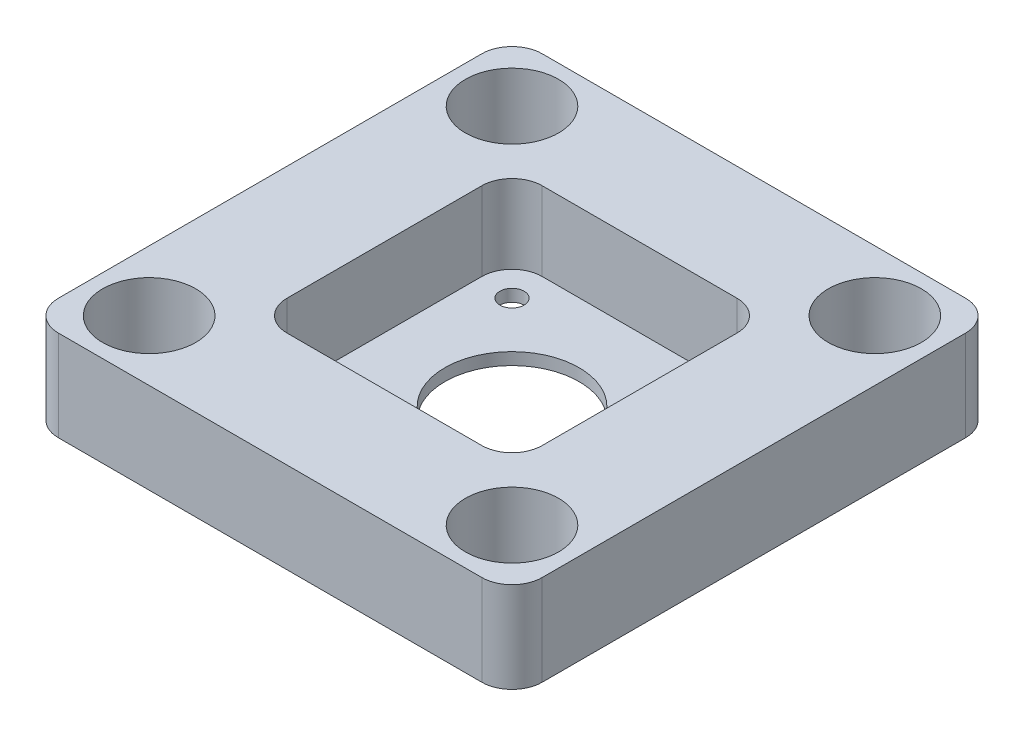
ISO-10303-21;
HEADER;
FILE_DESCRIPTION(('STEP AP214'),'2;1');
FILE_NAME('part.step','',(''),(''),'','','');
FILE_SCHEMA(('AUTOMOTIVE_DESIGN { 1 0 10303 214 1 1 1 1 }'));
ENDSEC;
DATA;
#1=APPLICATION_CONTEXT('core data for automotive mechanical design processes');
#2=APPLICATION_PROTOCOL_DEFINITION('international standard','automotive_design',2000,#1);
#3=PRODUCT_CONTEXT('',#1,'mechanical');
#4=PRODUCT('Part','Part','',(#3));
#5=PRODUCT_RELATED_PRODUCT_CATEGORY('part','',(#4));
#6=PRODUCT_DEFINITION_FORMATION('','',#4);
#7=PRODUCT_DEFINITION_CONTEXT('part definition',#1,'design');
#8=PRODUCT_DEFINITION('design','',#6,#7);
#9=PRODUCT_DEFINITION_SHAPE('','',#8);
#10=(LENGTH_UNIT() NAMED_UNIT(*) SI_UNIT(.MILLI.,.METRE.));
#11=(NAMED_UNIT(*) PLANE_ANGLE_UNIT() SI_UNIT($,.RADIAN.));
#12=(NAMED_UNIT(*) SI_UNIT($,.STERADIAN.) SOLID_ANGLE_UNIT());
#13=UNCERTAINTY_MEASURE_WITH_UNIT(LENGTH_MEASURE(1.E-05),#10,'distance_accuracy_value','');
#14=(GEOMETRIC_REPRESENTATION_CONTEXT(3) GLOBAL_UNCERTAINTY_ASSIGNED_CONTEXT((#13)) GLOBAL_UNIT_ASSIGNED_CONTEXT((#10,
#11,#12)) REPRESENTATION_CONTEXT('',''));
#15=CARTESIAN_POINT('',(0.,0.,0.));
#16=DIRECTION('',(0.,0.,1.));
#17=DIRECTION('',(1.,0.,0.));
#18=AXIS2_PLACEMENT_3D('',#15,#16,#17);
#19=CARTESIAN_POINT('',(-40.,15.,40.));
#20=DIRECTION('',(1.,0.,0.));
#21=DIRECTION('',(0.,0.,-1.));
#22=AXIS2_PLACEMENT_3D('',#19,#20,#21);
#23=PLANE('',#22);
#24=DIRECTION('',(0.,0.,1.));
#25=VECTOR('',#24,1.);
#26=CARTESIAN_POINT('',(-40.,15.,40.));
#27=LINE('',#26,#25);
#28=CARTESIAN_POINT('',(-40.,15.,-35.));
#29=VERTEX_POINT('',#28);
#30=CARTESIAN_POINT('',(-40.,15.,35.));
#31=VERTEX_POINT('',#30);
#32=EDGE_CURVE('E183',#29,#31,#27,.T.);
#33=ORIENTED_EDGE('',*,*,#32,.F.);
#34=DIRECTION('',(0.,-1.,0.));
#35=VECTOR('',#34,1.);
#36=CARTESIAN_POINT('',(-40.,15.,-35.));
#37=LINE('',#36,#35);
#38=CARTESIAN_POINT('',(-40.,0.,-35.));
#39=VERTEX_POINT('',#38);
#40=EDGE_CURVE('E233',#29,#39,#37,.T.);
#41=ORIENTED_EDGE('',*,*,#40,.T.);
#42=DIRECTION('',(0.,0.,1.));
#43=VECTOR('',#42,1.);
#44=CARTESIAN_POINT('',(-40.,0.,40.));
#45=LINE('',#44,#43);
#46=CARTESIAN_POINT('',(-40.,0.,35.));
#47=VERTEX_POINT('',#46);
#48=EDGE_CURVE('E194',#39,#47,#45,.T.);
#49=ORIENTED_EDGE('',*,*,#48,.T.);
#50=DIRECTION('',(0.,-1.,0.));
#51=VECTOR('',#50,1.);
#52=CARTESIAN_POINT('',(-40.,15.,35.));
#53=LINE('',#52,#51);
#54=EDGE_CURVE('E231',#47,#31,#53,.F.);
#55=ORIENTED_EDGE('',*,*,#54,.T.);
#56=EDGE_LOOP('',(#33,#41,#49,#55));
#57=FACE_BOUND('',#56,.T.);
#58=ADVANCED_FACE('F32',(#57),#23,.F.);
#59=CARTESIAN_POINT('',(40.,15.,40.));
#60=DIRECTION('',(0.,0.,-1.));
#61=DIRECTION('',(-1.,0.,0.));
#62=AXIS2_PLACEMENT_3D('',#59,#60,#61);
#63=PLANE('',#62);
#64=DIRECTION('',(1.,0.,0.));
#65=VECTOR('',#64,1.);
#66=CARTESIAN_POINT('',(40.,0.,40.));
#67=LINE('',#66,#65);
#68=CARTESIAN_POINT('',(-35.,0.,40.));
#69=VERTEX_POINT('',#68);
#70=CARTESIAN_POINT('',(35.,0.,40.));
#71=VERTEX_POINT('',#70);
#72=EDGE_CURVE('E197',#69,#71,#67,.T.);
#73=ORIENTED_EDGE('',*,*,#72,.T.);
#74=DIRECTION('',(0.,-1.,0.));
#75=VECTOR('',#74,1.);
#76=CARTESIAN_POINT('',(35.,15.,40.));
#77=LINE('',#76,#75);
#78=CARTESIAN_POINT('',(35.,15.,40.));
#79=VERTEX_POINT('',#78);
#80=EDGE_CURVE('E11',#71,#79,#77,.F.);
#81=ORIENTED_EDGE('',*,*,#80,.T.);
#82=DIRECTION('',(1.,0.,0.));
#83=VECTOR('',#82,1.);
#84=CARTESIAN_POINT('',(40.,15.,40.));
#85=LINE('',#84,#83);
#86=CARTESIAN_POINT('',(-35.,15.,40.));
#87=VERTEX_POINT('',#86);
#88=EDGE_CURVE('E186',#87,#79,#85,.T.);
#89=ORIENTED_EDGE('',*,*,#88,.F.);
#90=DIRECTION('',(0.,-1.,0.));
#91=VECTOR('',#90,1.);
#92=CARTESIAN_POINT('',(-35.,15.,40.));
#93=LINE('',#92,#91);
#94=EDGE_CURVE('E40',#87,#69,#93,.T.);
#95=ORIENTED_EDGE('',*,*,#94,.T.);
#96=EDGE_LOOP('',(#73,#81,#89,#95));
#97=FACE_BOUND('',#96,.T.);
#98=ADVANCED_FACE('F264',(#97),#63,.F.);
#99=CARTESIAN_POINT('',(40.,15.,40.));
#100=DIRECTION('',(-1.,0.,0.));
#101=DIRECTION('',(0.,0.,1.));
#102=AXIS2_PLACEMENT_3D('',#99,#100,#101);
#103=PLANE('',#102);
#104=DIRECTION('',(0.,0.,-1.));
#105=VECTOR('',#104,1.);
#106=CARTESIAN_POINT('',(40.,0.,40.));
#107=LINE('',#106,#105);
#108=CARTESIAN_POINT('',(40.,0.,35.));
#109=VERTEX_POINT('',#108);
#110=CARTESIAN_POINT('',(40.,0.,-35.));
#111=VERTEX_POINT('',#110);
#112=EDGE_CURVE('E201',#109,#111,#107,.T.);
#113=ORIENTED_EDGE('',*,*,#112,.T.);
#114=DIRECTION('',(0.,-1.,0.));
#115=VECTOR('',#114,1.);
#116=CARTESIAN_POINT('',(40.,15.,-35.));
#117=LINE('',#116,#115);
#118=CARTESIAN_POINT('',(40.,15.,-35.));
#119=VERTEX_POINT('',#118);
#120=EDGE_CURVE('E47',#111,#119,#117,.F.);
#121=ORIENTED_EDGE('',*,*,#120,.T.);
#122=DIRECTION('',(0.,0.,-1.));
#123=VECTOR('',#122,1.);
#124=CARTESIAN_POINT('',(40.,15.,40.));
#125=LINE('',#124,#123);
#126=CARTESIAN_POINT('',(40.,15.,35.));
#127=VERTEX_POINT('',#126);
#128=EDGE_CURVE('E189',#127,#119,#125,.T.);
#129=ORIENTED_EDGE('',*,*,#128,.F.);
#130=DIRECTION('',(0.,-1.,0.));
#131=VECTOR('',#130,1.);
#132=CARTESIAN_POINT('',(40.,15.,35.));
#133=LINE('',#132,#131);
#134=EDGE_CURVE('E256',#127,#109,#133,.T.);
#135=ORIENTED_EDGE('',*,*,#134,.T.);
#136=EDGE_LOOP('',(#113,#121,#129,#135));
#137=FACE_BOUND('',#136,.T.);
#138=ADVANCED_FACE('F275',(#137),#103,.F.);
#139=CARTESIAN_POINT('',(40.,15.,-40.));
#140=DIRECTION('',(0.,0.,1.));
#141=DIRECTION('',(1.,0.,0.));
#142=AXIS2_PLACEMENT_3D('',#139,#140,#141);
#143=PLANE('',#142);
#144=DIRECTION('',(-1.,0.,0.));
#145=VECTOR('',#144,1.);
#146=CARTESIAN_POINT('',(40.,0.,-40.));
#147=LINE('',#146,#145);
#148=CARTESIAN_POINT('',(35.,0.,-40.));
#149=VERTEX_POINT('',#148);
#150=CARTESIAN_POINT('',(-35.,0.,-40.));
#151=VERTEX_POINT('',#150);
#152=EDGE_CURVE('E187',#149,#151,#147,.T.);
#153=ORIENTED_EDGE('',*,*,#152,.T.);
#154=DIRECTION('',(0.,-1.,0.));
#155=VECTOR('',#154,1.);
#156=CARTESIAN_POINT('',(-35.,15.,-40.));
#157=LINE('',#156,#155);
#158=CARTESIAN_POINT('',(-35.,15.,-40.));
#159=VERTEX_POINT('',#158);
#160=EDGE_CURVE('E247',#151,#159,#157,.F.);
#161=ORIENTED_EDGE('',*,*,#160,.T.);
#162=DIRECTION('',(-1.,0.,0.));
#163=VECTOR('',#162,1.);
#164=CARTESIAN_POINT('',(40.,15.,-40.));
#165=LINE('',#164,#163);
#166=CARTESIAN_POINT('',(35.,15.,-40.));
#167=VERTEX_POINT('',#166);
#168=EDGE_CURVE('E191',#167,#159,#165,.T.);
#169=ORIENTED_EDGE('',*,*,#168,.F.);
#170=DIRECTION('',(0.,-1.,0.));
#171=VECTOR('',#170,1.);
#172=CARTESIAN_POINT('',(35.,15.,-40.));
#173=LINE('',#172,#171);
#174=EDGE_CURVE('E244',#167,#149,#173,.T.);
#175=ORIENTED_EDGE('',*,*,#174,.T.);
#176=EDGE_LOOP('',(#153,#161,#169,#175));
#177=FACE_BOUND('',#176,.T.);
#178=ADVANCED_FACE('F283',(#177),#143,.F.);
#179=CARTESIAN_POINT('',(0.,15.,0.));
#180=DIRECTION('',(0.,1.,0.));
#181=DIRECTION('',(0.,0.,1.));
#182=AXIS2_PLACEMENT_3D('',#179,#180,#181);
#183=PLANE('',#182);
#184=CARTESIAN_POINT('',(-30.,15.,30.));
#185=DIRECTION('',(0.,1.,0.));
#186=DIRECTION('',(0.,0.,-1.));
#187=AXIS2_PLACEMENT_3D('',#184,#185,#186);
#188=CIRCLE('',#187,7.7);
#189=CARTESIAN_POINT('',(-30.,15.,22.3));
#190=VERTEX_POINT('',#189);
#191=EDGE_CURVE('E551',#190,#190,#188,.T.);
#192=ORIENTED_EDGE('',*,*,#191,.F.);
#193=EDGE_LOOP('',(#192));
#194=FACE_BOUND('',#193,.T.);
#195=CARTESIAN_POINT('',(30.,15.,30.));
#196=DIRECTION('',(0.,1.,0.));
#197=DIRECTION('',(0.,0.,1.));
#198=AXIS2_PLACEMENT_3D('',#195,#196,#197);
#199=CIRCLE('',#198,7.7);
#200=CARTESIAN_POINT('',(30.,15.,37.7));
#201=VERTEX_POINT('',#200);
#202=EDGE_CURVE('E555',#201,#201,#199,.T.);
#203=ORIENTED_EDGE('',*,*,#202,.F.);
#204=EDGE_LOOP('',(#203));
#205=FACE_BOUND('',#204,.T.);
#206=CARTESIAN_POINT('',(30.,15.,-30.));
#207=DIRECTION('',(0.,1.,0.));
#208=DIRECTION('',(0.,0.,-1.));
#209=AXIS2_PLACEMENT_3D('',#206,#207,#208);
#210=CIRCLE('',#209,7.7);
#211=CARTESIAN_POINT('',(30.,15.,-37.7));
#212=VERTEX_POINT('',#211);
#213=EDGE_CURVE('E559',#212,#212,#210,.T.);
#214=ORIENTED_EDGE('',*,*,#213,.F.);
#215=EDGE_LOOP('',(#214));
#216=FACE_BOUND('',#215,.T.);
#217=CARTESIAN_POINT('',(-30.,15.,-30.));
#218=DIRECTION('',(0.,1.,0.));
#219=DIRECTION('',(0.,0.,1.));
#220=AXIS2_PLACEMENT_3D('',#217,#218,#219);
#221=CIRCLE('',#220,7.7);
#222=CARTESIAN_POINT('',(-30.,15.,-22.3));
#223=VERTEX_POINT('',#222);
#224=EDGE_CURVE('E562',#223,#223,#221,.T.);
#225=ORIENTED_EDGE('',*,*,#224,.F.);
#226=EDGE_LOOP('',(#225));
#227=FACE_BOUND('',#226,.T.);
#228=DIRECTION('',(0.,0.,1.));
#229=VECTOR('',#228,1.);
#230=CARTESIAN_POINT('',(-21.1,15.,21.1));
#231=LINE('',#230,#229);
#232=CARTESIAN_POINT('',(-21.1,15.,-16.1));
#233=VERTEX_POINT('',#232);
#234=CARTESIAN_POINT('',(-21.1,15.,16.1));
#235=VERTEX_POINT('',#234);
#236=EDGE_CURVE('E179',#233,#235,#231,.T.);
#237=ORIENTED_EDGE('',*,*,#236,.F.);
#238=CARTESIAN_POINT('',(-16.1,15.,-16.1));
#239=DIRECTION('',(0.,1.,0.));
#240=DIRECTION('',(0.,0.,1.));
#241=AXIS2_PLACEMENT_3D('',#238,#239,#240);
#242=CIRCLE('',#241,5.);
#243=CARTESIAN_POINT('',(-16.1,15.,-21.1));
#244=VERTEX_POINT('',#243);
#245=EDGE_CURVE('E229',#233,#244,#242,.F.);
#246=ORIENTED_EDGE('',*,*,#245,.T.);
#247=DIRECTION('',(-1.,0.,0.));
#248=VECTOR('',#247,1.);
#249=CARTESIAN_POINT('',(21.1,15.,-21.1));
#250=LINE('',#249,#248);
#251=CARTESIAN_POINT('',(16.1,15.,-21.1));
#252=VERTEX_POINT('',#251);
#253=EDGE_CURVE('E173',#252,#244,#250,.T.);
#254=ORIENTED_EDGE('',*,*,#253,.F.);
#255=CARTESIAN_POINT('',(16.1,15.,-16.1));
#256=DIRECTION('',(0.,1.,0.));
#257=DIRECTION('',(0.,0.,1.));
#258=AXIS2_PLACEMENT_3D('',#255,#256,#257);
#259=CIRCLE('',#258,5.);
#260=CARTESIAN_POINT('',(21.1,15.,-16.1));
#261=VERTEX_POINT('',#260);
#262=EDGE_CURVE('E156',#252,#261,#259,.F.);
#263=ORIENTED_EDGE('',*,*,#262,.T.);
#264=DIRECTION('',(0.,0.,-1.));
#265=VECTOR('',#264,1.);
#266=CARTESIAN_POINT('',(21.1,15.,21.1));
#267=LINE('',#266,#265);
#268=CARTESIAN_POINT('',(21.1,15.,16.1));
#269=VERTEX_POINT('',#268);
#270=EDGE_CURVE('E163',#269,#261,#267,.T.);
#271=ORIENTED_EDGE('',*,*,#270,.F.);
#272=CARTESIAN_POINT('',(16.1,15.,16.1));
#273=DIRECTION('',(0.,1.,0.));
#274=DIRECTION('',(0.,0.,1.));
#275=AXIS2_PLACEMENT_3D('',#272,#273,#274);
#276=CIRCLE('',#275,5.);
#277=CARTESIAN_POINT('',(16.1,15.,21.1));
#278=VERTEX_POINT('',#277);
#279=EDGE_CURVE('E146',#269,#278,#276,.F.);
#280=ORIENTED_EDGE('',*,*,#279,.T.);
#281=DIRECTION('',(1.,0.,0.));
#282=VECTOR('',#281,1.);
#283=CARTESIAN_POINT('',(21.1,15.,21.1));
#284=LINE('',#283,#282);
#285=CARTESIAN_POINT('',(-16.1,15.,21.1));
#286=VERTEX_POINT('',#285);
#287=EDGE_CURVE('E174',#286,#278,#284,.T.);
#288=ORIENTED_EDGE('',*,*,#287,.F.);
#289=CARTESIAN_POINT('',(-16.1,15.,16.1));
#290=DIRECTION('',(0.,1.,0.));
#291=DIRECTION('',(0.,0.,1.));
#292=AXIS2_PLACEMENT_3D('',#289,#290,#291);
#293=CIRCLE('',#292,5.);
#294=EDGE_CURVE('E227',#286,#235,#293,.F.);
#295=ORIENTED_EDGE('',*,*,#294,.T.);
#296=EDGE_LOOP('',(#237,#246,#254,#263,#271,#280,#288,#295));
#297=FACE_BOUND('',#296,.T.);
#298=ORIENTED_EDGE('',*,*,#168,.T.);
#299=CARTESIAN_POINT('',(-35.,15.,-35.));
#300=DIRECTION('',(0.,1.,0.));
#301=DIRECTION('',(0.,0.,1.));
#302=AXIS2_PLACEMENT_3D('',#299,#300,#301);
#303=CIRCLE('',#302,5.);
#304=EDGE_CURVE('E254',#159,#29,#303,.T.);
#305=ORIENTED_EDGE('',*,*,#304,.T.);
#306=ORIENTED_EDGE('',*,*,#32,.T.);
#307=CARTESIAN_POINT('',(-35.,15.,35.));
#308=DIRECTION('',(0.,1.,0.));
#309=DIRECTION('',(0.,0.,1.));
#310=AXIS2_PLACEMENT_3D('',#307,#308,#309);
#311=CIRCLE('',#310,5.);
#312=EDGE_CURVE('E249',#31,#87,#311,.T.);
#313=ORIENTED_EDGE('',*,*,#312,.T.);
#314=ORIENTED_EDGE('',*,*,#88,.T.);
#315=CARTESIAN_POINT('',(35.,15.,35.));
#316=DIRECTION('',(0.,1.,0.));
#317=DIRECTION('',(0.,0.,1.));
#318=AXIS2_PLACEMENT_3D('',#315,#316,#317);
#319=CIRCLE('',#318,5.);
#320=EDGE_CURVE('E54',#79,#127,#319,.T.);
#321=ORIENTED_EDGE('',*,*,#320,.T.);
#322=ORIENTED_EDGE('',*,*,#128,.T.);
#323=CARTESIAN_POINT('',(35.,15.,-35.));
#324=DIRECTION('',(0.,1.,0.));
#325=DIRECTION('',(0.,0.,1.));
#326=AXIS2_PLACEMENT_3D('',#323,#324,#325);
#327=CIRCLE('',#326,5.);
#328=EDGE_CURVE('E252',#119,#167,#327,.T.);
#329=ORIENTED_EDGE('',*,*,#328,.T.);
#330=EDGE_LOOP('',(#298,#305,#306,#313,#314,#321,#322,#329));
#331=FACE_BOUND('',#330,.T.);
#332=ADVANCED_FACE('F171',(#194,#205,#216,#227,#297,#331),#183,.T.);
#333=CARTESIAN_POINT('',(0.,0.,0.));
#334=DIRECTION('',(0.,1.,0.));
#335=DIRECTION('',(0.,0.,1.));
#336=AXIS2_PLACEMENT_3D('',#333,#334,#335);
#337=PLANE('',#336);
#338=CARTESIAN_POINT('',(-30.,0.,30.));
#339=DIRECTION('',(0.,1.,0.));
#340=DIRECTION('',(0.,0.,-1.));
#341=AXIS2_PLACEMENT_3D('',#338,#339,#340);
#342=CIRCLE('',#341,7.7);
#343=CARTESIAN_POINT('',(-30.,0.,22.3));
#344=VERTEX_POINT('',#343);
#345=EDGE_CURVE('E650',#344,#344,#342,.T.);
#346=ORIENTED_EDGE('',*,*,#345,.T.);
#347=EDGE_LOOP('',(#346));
#348=FACE_BOUND('',#347,.T.);
#349=CARTESIAN_POINT('',(30.,0.,30.));
#350=DIRECTION('',(0.,1.,0.));
#351=DIRECTION('',(0.,0.,1.));
#352=AXIS2_PLACEMENT_3D('',#349,#350,#351);
#353=CIRCLE('',#352,7.7);
#354=CARTESIAN_POINT('',(30.,0.,37.7));
#355=VERTEX_POINT('',#354);
#356=EDGE_CURVE('E647',#355,#355,#353,.T.);
#357=ORIENTED_EDGE('',*,*,#356,.T.);
#358=EDGE_LOOP('',(#357));
#359=FACE_BOUND('',#358,.T.);
#360=CARTESIAN_POINT('',(30.,0.,-30.));
#361=DIRECTION('',(0.,1.,0.));
#362=DIRECTION('',(0.,0.,-1.));
#363=AXIS2_PLACEMENT_3D('',#360,#361,#362);
#364=CIRCLE('',#363,7.7);
#365=CARTESIAN_POINT('',(30.,0.,-37.7));
#366=VERTEX_POINT('',#365);
#367=EDGE_CURVE('E565',#366,#366,#364,.T.);
#368=ORIENTED_EDGE('',*,*,#367,.T.);
#369=EDGE_LOOP('',(#368));
#370=FACE_BOUND('',#369,.T.);
#371=CARTESIAN_POINT('',(-30.,0.,-30.));
#372=DIRECTION('',(0.,1.,0.));
#373=DIRECTION('',(0.,0.,1.));
#374=AXIS2_PLACEMENT_3D('',#371,#372,#373);
#375=CIRCLE('',#374,7.7);
#376=CARTESIAN_POINT('',(-30.,0.,-22.3));
#377=VERTEX_POINT('',#376);
#378=EDGE_CURVE('E564',#377,#377,#375,.T.);
#379=ORIENTED_EDGE('',*,*,#378,.T.);
#380=EDGE_LOOP('',(#379));
#381=FACE_BOUND('',#380,.T.);
#382=CARTESIAN_POINT('',(-15.4999999999999,0.,15.5));
#383=DIRECTION('',(0.,1.,0.));
#384=DIRECTION('',(0.,0.,-1.));
#385=AXIS2_PLACEMENT_3D('',#382,#383,#384);
#386=CIRCLE('',#385,2.);
#387=CARTESIAN_POINT('',(-15.4999999999999,0.,13.5));
#388=VERTEX_POINT('',#387);
#389=EDGE_CURVE('E574',#388,#388,#386,.T.);
#390=ORIENTED_EDGE('',*,*,#389,.T.);
#391=EDGE_LOOP('',(#390));
#392=FACE_BOUND('',#391,.T.);
#393=CARTESIAN_POINT('',(15.5,0.,15.5));
#394=DIRECTION('',(0.,1.,0.));
#395=DIRECTION('',(0.,0.,1.));
#396=AXIS2_PLACEMENT_3D('',#393,#394,#395);
#397=CIRCLE('',#396,2.);
#398=CARTESIAN_POINT('',(15.5,0.,17.5));
#399=VERTEX_POINT('',#398);
#400=EDGE_CURVE('E580',#399,#399,#397,.T.);
#401=ORIENTED_EDGE('',*,*,#400,.T.);
#402=EDGE_LOOP('',(#401));
#403=FACE_BOUND('',#402,.T.);
#404=CARTESIAN_POINT('',(15.5,0.,-15.5));
#405=DIRECTION('',(0.,1.,0.));
#406=DIRECTION('',(0.,0.,-1.));
#407=AXIS2_PLACEMENT_3D('',#404,#405,#406);
#408=CIRCLE('',#407,2.);
#409=CARTESIAN_POINT('',(15.5,0.,-17.5));
#410=VERTEX_POINT('',#409);
#411=EDGE_CURVE('E586',#410,#410,#408,.T.);
#412=ORIENTED_EDGE('',*,*,#411,.T.);
#413=EDGE_LOOP('',(#412));
#414=FACE_BOUND('',#413,.T.);
#415=CARTESIAN_POINT('',(-15.5,0.,-15.5));
#416=DIRECTION('',(0.,1.,0.));
#417=DIRECTION('',(0.,0.,1.));
#418=AXIS2_PLACEMENT_3D('',#415,#416,#417);
#419=CIRCLE('',#418,2.);
#420=CARTESIAN_POINT('',(-15.5,0.,-13.5));
#421=VERTEX_POINT('',#420);
#422=EDGE_CURVE('E592',#421,#421,#419,.T.);
#423=ORIENTED_EDGE('',*,*,#422,.T.);
#424=EDGE_LOOP('',(#423));
#425=FACE_BOUND('',#424,.T.);
#426=CARTESIAN_POINT('',(0.,0.,0.));
#427=DIRECTION('',(0.,1.,0.));
#428=DIRECTION('',(0.,0.,1.));
#429=AXIS2_PLACEMENT_3D('',#426,#427,#428);
#430=CIRCLE('',#429,11.1);
#431=CARTESIAN_POINT('',(0.,0.,11.1));
#432=VERTEX_POINT('',#431);
#433=EDGE_CURVE('E598',#432,#432,#430,.T.);
#434=ORIENTED_EDGE('',*,*,#433,.T.);
#435=EDGE_LOOP('',(#434));
#436=FACE_BOUND('',#435,.T.);
#437=ORIENTED_EDGE('',*,*,#48,.F.);
#438=CARTESIAN_POINT('',(-35.,0.,-35.));
#439=DIRECTION('',(0.,1.,0.));
#440=DIRECTION('',(0.,0.,1.));
#441=AXIS2_PLACEMENT_3D('',#438,#439,#440);
#442=CIRCLE('',#441,5.);
#443=EDGE_CURVE('E242',#39,#151,#442,.F.);
#444=ORIENTED_EDGE('',*,*,#443,.T.);
#445=ORIENTED_EDGE('',*,*,#152,.F.);
#446=CARTESIAN_POINT('',(35.,0.,-35.));
#447=DIRECTION('',(0.,1.,0.));
#448=DIRECTION('',(0.,0.,1.));
#449=AXIS2_PLACEMENT_3D('',#446,#447,#448);
#450=CIRCLE('',#449,5.);
#451=EDGE_CURVE('E240',#149,#111,#450,.F.);
#452=ORIENTED_EDGE('',*,*,#451,.T.);
#453=ORIENTED_EDGE('',*,*,#112,.F.);
#454=CARTESIAN_POINT('',(35.,0.,35.));
#455=DIRECTION('',(0.,1.,0.));
#456=DIRECTION('',(0.,0.,1.));
#457=AXIS2_PLACEMENT_3D('',#454,#455,#456);
#458=CIRCLE('',#457,5.);
#459=EDGE_CURVE('E238',#109,#71,#458,.F.);
#460=ORIENTED_EDGE('',*,*,#459,.T.);
#461=ORIENTED_EDGE('',*,*,#72,.F.);
#462=CARTESIAN_POINT('',(-35.,0.,35.));
#463=DIRECTION('',(0.,1.,0.));
#464=DIRECTION('',(0.,0.,1.));
#465=AXIS2_PLACEMENT_3D('',#462,#463,#464);
#466=CIRCLE('',#465,5.);
#467=EDGE_CURVE('E236',#69,#47,#466,.F.);
#468=ORIENTED_EDGE('',*,*,#467,.T.);
#469=EDGE_LOOP('',(#437,#444,#445,#452,#453,#460,#461,#468));
#470=FACE_BOUND('',#469,.T.);
#471=ADVANCED_FACE('F270',(#348,#359,#370,#381,#392,#403,#414,#425,#436,#470),#337,.F.);
#472=CARTESIAN_POINT('',(-21.1,2.,21.1));
#473=DIRECTION('',(-1.,0.,0.));
#474=DIRECTION('',(0.,0.,1.));
#475=AXIS2_PLACEMENT_3D('',#472,#473,#474);
#476=PLANE('',#475);
#477=ORIENTED_EDGE('',*,*,#236,.T.);
#478=DIRECTION('',(0.,1.,0.));
#479=VECTOR('',#478,1.);
#480=CARTESIAN_POINT('',(-21.1,2.,16.1));
#481=LINE('',#480,#479);
#482=CARTESIAN_POINT('',(-21.1,2.,16.1));
#483=VERTEX_POINT('',#482);
#484=EDGE_CURVE('E157',#235,#483,#481,.F.);
#485=ORIENTED_EDGE('',*,*,#484,.T.);
#486=DIRECTION('',(0.,0.,1.));
#487=VECTOR('',#486,1.);
#488=CARTESIAN_POINT('',(-21.1,2.,21.1));
#489=LINE('',#488,#487);
#490=CARTESIAN_POINT('',(-21.1,2.,-16.1));
#491=VERTEX_POINT('',#490);
#492=EDGE_CURVE('E177',#491,#483,#489,.T.);
#493=ORIENTED_EDGE('',*,*,#492,.F.);
#494=DIRECTION('',(0.,1.,0.));
#495=VECTOR('',#494,1.);
#496=CARTESIAN_POINT('',(-21.1,15.,-16.1));
#497=LINE('',#496,#495);
#498=EDGE_CURVE('E222',#491,#233,#497,.T.);
#499=ORIENTED_EDGE('',*,*,#498,.T.);
#500=EDGE_LOOP('',(#477,#485,#493,#499));
#501=FACE_BOUND('',#500,.T.);
#502=ADVANCED_FACE('F477',(#501),#476,.F.);
#503=CARTESIAN_POINT('',(21.1,2.,-21.1));
#504=DIRECTION('',(0.,0.,-1.));
#505=DIRECTION('',(-1.,0.,0.));
#506=AXIS2_PLACEMENT_3D('',#503,#504,#505);
#507=PLANE('',#506);
#508=DIRECTION('',(-1.,0.,0.));
#509=VECTOR('',#508,1.);
#510=CARTESIAN_POINT('',(21.1,2.,-21.1));
#511=LINE('',#510,#509);
#512=CARTESIAN_POINT('',(16.1,2.,-21.1));
#513=VERTEX_POINT('',#512);
#514=CARTESIAN_POINT('',(-16.1,2.,-21.1));
#515=VERTEX_POINT('',#514);
#516=EDGE_CURVE('E198',#513,#515,#511,.T.);
#517=ORIENTED_EDGE('',*,*,#516,.F.);
#518=DIRECTION('',(0.,1.,0.));
#519=VECTOR('',#518,1.);
#520=CARTESIAN_POINT('',(16.1,15.,-21.1));
#521=LINE('',#520,#519);
#522=EDGE_CURVE('E219',#513,#252,#521,.T.);
#523=ORIENTED_EDGE('',*,*,#522,.T.);
#524=ORIENTED_EDGE('',*,*,#253,.T.);
#525=DIRECTION('',(0.,1.,0.));
#526=VECTOR('',#525,1.);
#527=CARTESIAN_POINT('',(-16.1,2.,-21.1));
#528=LINE('',#527,#526);
#529=EDGE_CURVE('E217',#244,#515,#528,.F.);
#530=ORIENTED_EDGE('',*,*,#529,.T.);
#531=EDGE_LOOP('',(#517,#523,#524,#530));
#532=FACE_BOUND('',#531,.T.);
#533=ADVANCED_FACE('F469',(#532),#507,.F.);
#534=CARTESIAN_POINT('',(21.1,2.,21.1));
#535=DIRECTION('',(1.,0.,0.));
#536=DIRECTION('',(0.,0.,-1.));
#537=AXIS2_PLACEMENT_3D('',#534,#535,#536);
#538=PLANE('',#537);
#539=DIRECTION('',(0.,0.,-1.));
#540=VECTOR('',#539,1.);
#541=CARTESIAN_POINT('',(21.1,2.,21.1));
#542=LINE('',#541,#540);
#543=CARTESIAN_POINT('',(21.1,2.,16.1));
#544=VERTEX_POINT('',#543);
#545=CARTESIAN_POINT('',(21.1,2.,-16.1));
#546=VERTEX_POINT('',#545);
#547=EDGE_CURVE('E166',#544,#546,#542,.T.);
#548=ORIENTED_EDGE('',*,*,#547,.F.);
#549=DIRECTION('',(0.,1.,0.));
#550=VECTOR('',#549,1.);
#551=CARTESIAN_POINT('',(21.1,15.,16.1));
#552=LINE('',#551,#550);
#553=EDGE_CURVE('E150',#544,#269,#552,.T.);
#554=ORIENTED_EDGE('',*,*,#553,.T.);
#555=ORIENTED_EDGE('',*,*,#270,.T.);
#556=DIRECTION('',(0.,1.,0.));
#557=VECTOR('',#556,1.);
#558=CARTESIAN_POINT('',(21.1,2.,-16.1));
#559=LINE('',#558,#557);
#560=EDGE_CURVE('E168',#261,#546,#559,.F.);
#561=ORIENTED_EDGE('',*,*,#560,.T.);
#562=EDGE_LOOP('',(#548,#554,#555,#561));
#563=FACE_BOUND('',#562,.T.);
#564=ADVANCED_FACE('F162',(#563),#538,.F.);
#565=CARTESIAN_POINT('',(21.1,2.,21.1));
#566=DIRECTION('',(0.,0.,1.));
#567=DIRECTION('',(1.,0.,0.));
#568=AXIS2_PLACEMENT_3D('',#565,#566,#567);
#569=PLANE('',#568);
#570=ORIENTED_EDGE('',*,*,#287,.T.);
#571=DIRECTION('',(0.,1.,0.));
#572=VECTOR('',#571,1.);
#573=CARTESIAN_POINT('',(16.1,2.,21.1));
#574=LINE('',#573,#572);
#575=CARTESIAN_POINT('',(16.1,2.,21.1));
#576=VERTEX_POINT('',#575);
#577=EDGE_CURVE('E151',#278,#576,#574,.F.);
#578=ORIENTED_EDGE('',*,*,#577,.T.);
#579=DIRECTION('',(1.,0.,0.));
#580=VECTOR('',#579,1.);
#581=CARTESIAN_POINT('',(21.1,2.,21.1));
#582=LINE('',#581,#580);
#583=CARTESIAN_POINT('',(-16.1,2.,21.1));
#584=VERTEX_POINT('',#583);
#585=EDGE_CURVE('E605',#584,#576,#582,.T.);
#586=ORIENTED_EDGE('',*,*,#585,.F.);
#587=DIRECTION('',(0.,1.,0.));
#588=VECTOR('',#587,1.);
#589=CARTESIAN_POINT('',(-16.1,15.,21.1));
#590=LINE('',#589,#588);
#591=EDGE_CURVE('E167',#584,#286,#590,.T.);
#592=ORIENTED_EDGE('',*,*,#591,.T.);
#593=EDGE_LOOP('',(#570,#578,#586,#592));
#594=FACE_BOUND('',#593,.T.);
#595=ADVANCED_FACE('F453',(#594),#569,.F.);
#596=CARTESIAN_POINT('',(0.,2.,0.));
#597=DIRECTION('',(0.,1.,0.));
#598=DIRECTION('',(0.,0.,1.));
#599=AXIS2_PLACEMENT_3D('',#596,#597,#598);
#600=PLANE('',#599);
#601=CARTESIAN_POINT('',(-15.4999999999999,2.,15.5));
#602=DIRECTION('',(0.,1.,0.));
#603=DIRECTION('',(0.,0.,-1.));
#604=AXIS2_PLACEMENT_3D('',#601,#602,#603);
#605=CIRCLE('',#604,2.);
#606=CARTESIAN_POINT('',(-15.4999999999999,2.,13.5));
#607=VERTEX_POINT('',#606);
#608=EDGE_CURVE('E568',#607,#607,#605,.T.);
#609=ORIENTED_EDGE('',*,*,#608,.F.);
#610=EDGE_LOOP('',(#609));
#611=FACE_BOUND('',#610,.T.);
#612=CARTESIAN_POINT('',(15.5,2.,15.5));
#613=DIRECTION('',(0.,1.,0.));
#614=DIRECTION('',(0.,0.,1.));
#615=AXIS2_PLACEMENT_3D('',#612,#613,#614);
#616=CIRCLE('',#615,2.);
#617=CARTESIAN_POINT('',(15.5,2.,17.5));
#618=VERTEX_POINT('',#617);
#619=EDGE_CURVE('E577',#618,#618,#616,.T.);
#620=ORIENTED_EDGE('',*,*,#619,.F.);
#621=EDGE_LOOP('',(#620));
#622=FACE_BOUND('',#621,.T.);
#623=CARTESIAN_POINT('',(15.5,2.,-15.5));
#624=DIRECTION('',(0.,1.,0.));
#625=DIRECTION('',(0.,0.,-1.));
#626=AXIS2_PLACEMENT_3D('',#623,#624,#625);
#627=CIRCLE('',#626,2.);
#628=CARTESIAN_POINT('',(15.5,2.,-17.5));
#629=VERTEX_POINT('',#628);
#630=EDGE_CURVE('E583',#629,#629,#627,.T.);
#631=ORIENTED_EDGE('',*,*,#630,.F.);
#632=EDGE_LOOP('',(#631));
#633=FACE_BOUND('',#632,.T.);
#634=CARTESIAN_POINT('',(-15.5,2.,-15.5));
#635=DIRECTION('',(0.,1.,0.));
#636=DIRECTION('',(0.,0.,1.));
#637=AXIS2_PLACEMENT_3D('',#634,#635,#636);
#638=CIRCLE('',#637,2.);
#639=CARTESIAN_POINT('',(-15.5,2.,-13.5));
#640=VERTEX_POINT('',#639);
#641=EDGE_CURVE('E589',#640,#640,#638,.T.);
#642=ORIENTED_EDGE('',*,*,#641,.F.);
#643=EDGE_LOOP('',(#642));
#644=FACE_BOUND('',#643,.T.);
#645=CARTESIAN_POINT('',(0.,2.,0.));
#646=DIRECTION('',(0.,1.,0.));
#647=DIRECTION('',(0.,0.,1.));
#648=AXIS2_PLACEMENT_3D('',#645,#646,#647);
#649=CIRCLE('',#648,11.1);
#650=CARTESIAN_POINT('',(0.,2.,11.1));
#651=VERTEX_POINT('',#650);
#652=EDGE_CURVE('E595',#651,#651,#649,.T.);
#653=ORIENTED_EDGE('',*,*,#652,.F.);
#654=EDGE_LOOP('',(#653));
#655=FACE_BOUND('',#654,.T.);
#656=ORIENTED_EDGE('',*,*,#585,.T.);
#657=CARTESIAN_POINT('',(16.1,2.,16.1));
#658=DIRECTION('',(0.,1.,0.));
#659=DIRECTION('',(0.,0.,1.));
#660=AXIS2_PLACEMENT_3D('',#657,#658,#659);
#661=CIRCLE('',#660,5.);
#662=EDGE_CURVE('E215',#576,#544,#661,.T.);
#663=ORIENTED_EDGE('',*,*,#662,.T.);
#664=ORIENTED_EDGE('',*,*,#547,.T.);
#665=CARTESIAN_POINT('',(16.1,2.,-16.1));
#666=DIRECTION('',(0.,1.,0.));
#667=DIRECTION('',(0.,0.,1.));
#668=AXIS2_PLACEMENT_3D('',#665,#666,#667);
#669=CIRCLE('',#668,5.);
#670=EDGE_CURVE('E213',#546,#513,#669,.T.);
#671=ORIENTED_EDGE('',*,*,#670,.T.);
#672=ORIENTED_EDGE('',*,*,#516,.T.);
#673=CARTESIAN_POINT('',(-16.1,2.,-16.1));
#674=DIRECTION('',(0.,1.,0.));
#675=DIRECTION('',(0.,0.,1.));
#676=AXIS2_PLACEMENT_3D('',#673,#674,#675);
#677=CIRCLE('',#676,5.);
#678=EDGE_CURVE('E209',#515,#491,#677,.T.);
#679=ORIENTED_EDGE('',*,*,#678,.T.);
#680=ORIENTED_EDGE('',*,*,#492,.T.);
#681=CARTESIAN_POINT('',(-16.1,2.,16.1));
#682=DIRECTION('',(0.,1.,0.));
#683=DIRECTION('',(0.,0.,1.));
#684=AXIS2_PLACEMENT_3D('',#681,#682,#683);
#685=CIRCLE('',#684,5.);
#686=EDGE_CURVE('E211',#483,#584,#685,.T.);
#687=ORIENTED_EDGE('',*,*,#686,.T.);
#688=EDGE_LOOP('',(#656,#663,#664,#671,#672,#679,#680,#687));
#689=FACE_BOUND('',#688,.T.);
#690=ADVANCED_FACE('F307',(#611,#622,#633,#644,#655,#689),#600,.T.);
#691=CARTESIAN_POINT('',(16.1,2.,16.1));
#692=DIRECTION('',(0.,-1.,0.));
#693=DIRECTION('',(0.,0.,-1.));
#694=AXIS2_PLACEMENT_3D('',#691,#692,#693);
#695=CYLINDRICAL_SURFACE('',#694,5.);
#696=ORIENTED_EDGE('',*,*,#662,.F.);
#697=ORIENTED_EDGE('',*,*,#577,.F.);
#698=ORIENTED_EDGE('',*,*,#279,.F.);
#699=ORIENTED_EDGE('',*,*,#553,.F.);
#700=EDGE_LOOP('',(#696,#697,#698,#699));
#701=FACE_BOUND('',#700,.T.);
#702=ADVANCED_FACE('F149',(#701),#695,.F.);
#703=CARTESIAN_POINT('',(16.1,2.,-16.1));
#704=DIRECTION('',(0.,-1.,0.));
#705=DIRECTION('',(0.,0.,-1.));
#706=AXIS2_PLACEMENT_3D('',#703,#704,#705);
#707=CYLINDRICAL_SURFACE('',#706,5.);
#708=ORIENTED_EDGE('',*,*,#670,.F.);
#709=ORIENTED_EDGE('',*,*,#560,.F.);
#710=ORIENTED_EDGE('',*,*,#262,.F.);
#711=ORIENTED_EDGE('',*,*,#522,.F.);
#712=EDGE_LOOP('',(#708,#709,#710,#711));
#713=FACE_BOUND('',#712,.T.);
#714=ADVANCED_FACE('F306',(#713),#707,.F.);
#715=CARTESIAN_POINT('',(-16.1,2.,16.1));
#716=DIRECTION('',(0.,-1.,0.));
#717=DIRECTION('',(0.,0.,-1.));
#718=AXIS2_PLACEMENT_3D('',#715,#716,#717);
#719=CYLINDRICAL_SURFACE('',#718,5.);
#720=ORIENTED_EDGE('',*,*,#686,.F.);
#721=ORIENTED_EDGE('',*,*,#484,.F.);
#722=ORIENTED_EDGE('',*,*,#294,.F.);
#723=ORIENTED_EDGE('',*,*,#591,.F.);
#724=EDGE_LOOP('',(#720,#721,#722,#723));
#725=FACE_BOUND('',#724,.T.);
#726=ADVANCED_FACE('F310',(#725),#719,.F.);
#727=CARTESIAN_POINT('',(-16.1,2.,-16.1));
#728=DIRECTION('',(0.,-1.,0.));
#729=DIRECTION('',(0.,0.,-1.));
#730=AXIS2_PLACEMENT_3D('',#727,#728,#729);
#731=CYLINDRICAL_SURFACE('',#730,5.);
#732=ORIENTED_EDGE('',*,*,#678,.F.);
#733=ORIENTED_EDGE('',*,*,#529,.F.);
#734=ORIENTED_EDGE('',*,*,#245,.F.);
#735=ORIENTED_EDGE('',*,*,#498,.F.);
#736=EDGE_LOOP('',(#732,#733,#734,#735));
#737=FACE_BOUND('',#736,.T.);
#738=ADVANCED_FACE('F314',(#737),#731,.F.);
#739=CARTESIAN_POINT('',(0.,0.,0.));
#740=DIRECTION('',(0.,1.,0.));
#741=DIRECTION('',(0.,0.,1.));
#742=AXIS2_PLACEMENT_3D('',#739,#740,#741);
#743=CYLINDRICAL_SURFACE('',#742,11.1);
#744=ORIENTED_EDGE('',*,*,#433,.F.);
#745=EDGE_LOOP('',(#744));
#746=FACE_BOUND('',#745,.T.);
#747=ORIENTED_EDGE('',*,*,#652,.T.);
#748=EDGE_LOOP('',(#747));
#749=FACE_BOUND('',#748,.T.);
#750=ADVANCED_FACE('F318',(#746,#749),#743,.F.);
#751=CARTESIAN_POINT('',(-15.5,0.,-15.5));
#752=DIRECTION('',(0.,1.,0.));
#753=DIRECTION('',(0.,0.,1.));
#754=AXIS2_PLACEMENT_3D('',#751,#752,#753);
#755=CYLINDRICAL_SURFACE('',#754,2.);
#756=ORIENTED_EDGE('',*,*,#422,.F.);
#757=EDGE_LOOP('',(#756));
#758=FACE_BOUND('',#757,.T.);
#759=ORIENTED_EDGE('',*,*,#641,.T.);
#760=EDGE_LOOP('',(#759));
#761=FACE_BOUND('',#760,.T.);
#762=ADVANCED_FACE('F407',(#758,#761),#755,.F.);
#763=CARTESIAN_POINT('',(15.5,0.,-15.5));
#764=DIRECTION('',(0.,1.,0.));
#765=DIRECTION('',(0.,0.,1.));
#766=AXIS2_PLACEMENT_3D('',#763,#764,#765);
#767=CYLINDRICAL_SURFACE('',#766,2.);
#768=ORIENTED_EDGE('',*,*,#411,.F.);
#769=EDGE_LOOP('',(#768));
#770=FACE_BOUND('',#769,.T.);
#771=ORIENTED_EDGE('',*,*,#630,.T.);
#772=EDGE_LOOP('',(#771));
#773=FACE_BOUND('',#772,.T.);
#774=ADVANCED_FACE('F398',(#770,#773),#767,.F.);
#775=CARTESIAN_POINT('',(15.5,0.,15.5));
#776=DIRECTION('',(0.,1.,0.));
#777=DIRECTION('',(0.,0.,1.));
#778=AXIS2_PLACEMENT_3D('',#775,#776,#777);
#779=CYLINDRICAL_SURFACE('',#778,2.);
#780=ORIENTED_EDGE('',*,*,#400,.F.);
#781=EDGE_LOOP('',(#780));
#782=FACE_BOUND('',#781,.T.);
#783=ORIENTED_EDGE('',*,*,#619,.T.);
#784=EDGE_LOOP('',(#783));
#785=FACE_BOUND('',#784,.T.);
#786=ADVANCED_FACE('F389',(#782,#785),#779,.F.);
#787=CARTESIAN_POINT('',(-15.4999999999999,0.,15.5));
#788=DIRECTION('',(0.,1.,0.));
#789=DIRECTION('',(0.,0.,1.));
#790=AXIS2_PLACEMENT_3D('',#787,#788,#789);
#791=CYLINDRICAL_SURFACE('',#790,2.);
#792=ORIENTED_EDGE('',*,*,#389,.F.);
#793=EDGE_LOOP('',(#792));
#794=FACE_BOUND('',#793,.T.);
#795=ORIENTED_EDGE('',*,*,#608,.T.);
#796=EDGE_LOOP('',(#795));
#797=FACE_BOUND('',#796,.T.);
#798=ADVANCED_FACE('F380',(#794,#797),#791,.F.);
#799=CARTESIAN_POINT('',(-30.,0.,-30.));
#800=DIRECTION('',(0.,1.,0.));
#801=DIRECTION('',(0.,0.,1.));
#802=AXIS2_PLACEMENT_3D('',#799,#800,#801);
#803=CYLINDRICAL_SURFACE('',#802,7.7);
#804=ORIENTED_EDGE('',*,*,#378,.F.);
#805=EDGE_LOOP('',(#804));
#806=FACE_BOUND('',#805,.T.);
#807=ORIENTED_EDGE('',*,*,#224,.T.);
#808=EDGE_LOOP('',(#807));
#809=FACE_BOUND('',#808,.T.);
#810=ADVANCED_FACE('F371',(#806,#809),#803,.F.);
#811=CARTESIAN_POINT('',(30.,0.,-30.));
#812=DIRECTION('',(0.,1.,0.));
#813=DIRECTION('',(0.,0.,1.));
#814=AXIS2_PLACEMENT_3D('',#811,#812,#813);
#815=CYLINDRICAL_SURFACE('',#814,7.7);
#816=ORIENTED_EDGE('',*,*,#367,.F.);
#817=EDGE_LOOP('',(#816));
#818=FACE_BOUND('',#817,.T.);
#819=ORIENTED_EDGE('',*,*,#213,.T.);
#820=EDGE_LOOP('',(#819));
#821=FACE_BOUND('',#820,.T.);
#822=ADVANCED_FACE('F362',(#818,#821),#815,.F.);
#823=CARTESIAN_POINT('',(30.,0.,30.));
#824=DIRECTION('',(0.,1.,0.));
#825=DIRECTION('',(0.,0.,1.));
#826=AXIS2_PLACEMENT_3D('',#823,#824,#825);
#827=CYLINDRICAL_SURFACE('',#826,7.7);
#828=ORIENTED_EDGE('',*,*,#356,.F.);
#829=EDGE_LOOP('',(#828));
#830=FACE_BOUND('',#829,.T.);
#831=ORIENTED_EDGE('',*,*,#202,.T.);
#832=EDGE_LOOP('',(#831));
#833=FACE_BOUND('',#832,.T.);
#834=ADVANCED_FACE('F353',(#830,#833),#827,.F.);
#835=CARTESIAN_POINT('',(-30.,0.,30.));
#836=DIRECTION('',(0.,1.,0.));
#837=DIRECTION('',(0.,0.,1.));
#838=AXIS2_PLACEMENT_3D('',#835,#836,#837);
#839=CYLINDRICAL_SURFACE('',#838,7.7);
#840=ORIENTED_EDGE('',*,*,#345,.F.);
#841=EDGE_LOOP('',(#840));
#842=FACE_BOUND('',#841,.T.);
#843=ORIENTED_EDGE('',*,*,#191,.T.);
#844=EDGE_LOOP('',(#843));
#845=FACE_BOUND('',#844,.T.);
#846=ADVANCED_FACE('F322',(#842,#845),#839,.F.);
#847=CARTESIAN_POINT('',(-35.,15.,-35.));
#848=DIRECTION('',(0.,-1.,0.));
#849=DIRECTION('',(0.,0.,-1.));
#850=AXIS2_PLACEMENT_3D('',#847,#848,#849);
#851=CYLINDRICAL_SURFACE('',#850,5.);
#852=ORIENTED_EDGE('',*,*,#304,.F.);
#853=ORIENTED_EDGE('',*,*,#160,.F.);
#854=ORIENTED_EDGE('',*,*,#443,.F.);
#855=ORIENTED_EDGE('',*,*,#40,.F.);
#856=EDGE_LOOP('',(#852,#853,#854,#855));
#857=FACE_BOUND('',#856,.T.);
#858=ADVANCED_FACE('F288',(#857),#851,.T.);
#859=CARTESIAN_POINT('',(35.,15.,-35.));
#860=DIRECTION('',(0.,-1.,0.));
#861=DIRECTION('',(0.,0.,-1.));
#862=AXIS2_PLACEMENT_3D('',#859,#860,#861);
#863=CYLINDRICAL_SURFACE('',#862,5.);
#864=ORIENTED_EDGE('',*,*,#328,.F.);
#865=ORIENTED_EDGE('',*,*,#120,.F.);
#866=ORIENTED_EDGE('',*,*,#451,.F.);
#867=ORIENTED_EDGE('',*,*,#174,.F.);
#868=EDGE_LOOP('',(#864,#865,#866,#867));
#869=FACE_BOUND('',#868,.T.);
#870=ADVANCED_FACE('F280',(#869),#863,.T.);
#871=CARTESIAN_POINT('',(35.,15.,35.));
#872=DIRECTION('',(0.,-1.,0.));
#873=DIRECTION('',(0.,0.,-1.));
#874=AXIS2_PLACEMENT_3D('',#871,#872,#873);
#875=CYLINDRICAL_SURFACE('',#874,5.);
#876=ORIENTED_EDGE('',*,*,#320,.F.);
#877=ORIENTED_EDGE('',*,*,#80,.F.);
#878=ORIENTED_EDGE('',*,*,#459,.F.);
#879=ORIENTED_EDGE('',*,*,#134,.F.);
#880=EDGE_LOOP('',(#876,#877,#878,#879));
#881=FACE_BOUND('',#880,.T.);
#882=ADVANCED_FACE('F274',(#881),#875,.T.);
#883=CARTESIAN_POINT('',(-35.,15.,35.));
#884=DIRECTION('',(0.,-1.,0.));
#885=DIRECTION('',(0.,0.,-1.));
#886=AXIS2_PLACEMENT_3D('',#883,#884,#885);
#887=CYLINDRICAL_SURFACE('',#886,5.);
#888=ORIENTED_EDGE('',*,*,#312,.F.);
#889=ORIENTED_EDGE('',*,*,#54,.F.);
#890=ORIENTED_EDGE('',*,*,#467,.F.);
#891=ORIENTED_EDGE('',*,*,#94,.F.);
#892=EDGE_LOOP('',(#888,#889,#890,#891));
#893=FACE_BOUND('',#892,.T.);
#894=ADVANCED_FACE('F34',(#893),#887,.T.);
#895=CLOSED_SHELL('',(#58,#98,#138,#178,#332,#471,#502,#533,#564,#595,#690,#702,#714,#726,#738,
#750,#762,#774,#786,#798,#810,#822,#834,#846,#858,#870,#882,#894));
#896=MANIFOLD_SOLID_BREP('B2',#895);
#897=ADVANCED_BREP_SHAPE_REPRESENTATION('',(#18,#896),#14);
#898=SHAPE_DEFINITION_REPRESENTATION(#9,#897);
ENDSEC;
END-ISO-10303-21;
